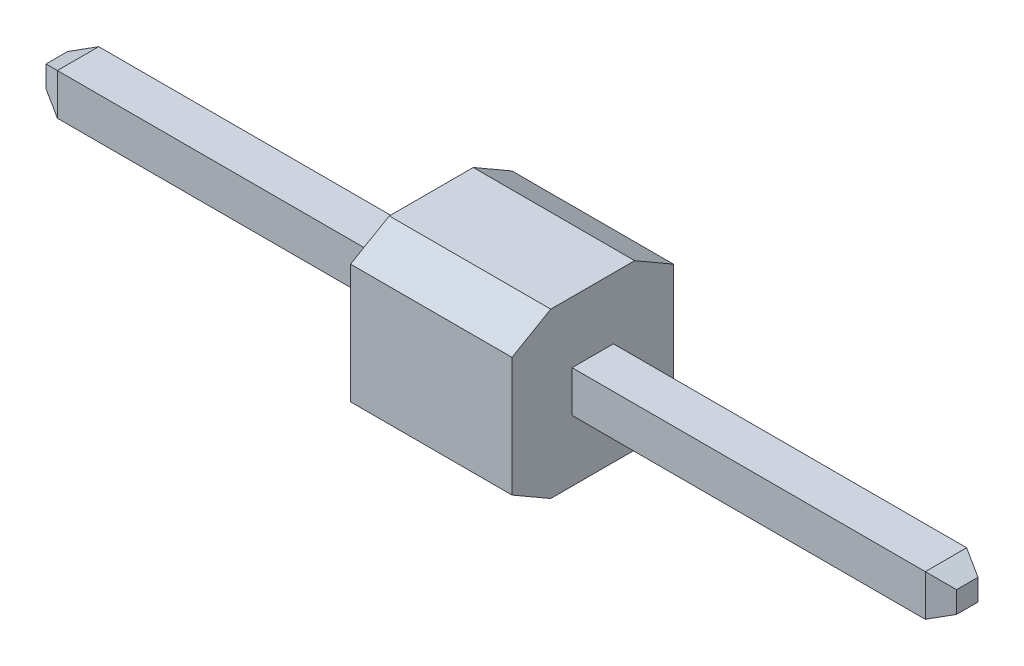
ISO-10303-21;
HEADER;
FILE_DESCRIPTION(('STEP AP214'),'2;1');
FILE_NAME('part.step','',(''),(''),'','','');
FILE_SCHEMA(('AUTOMOTIVE_DESIGN { 1 0 10303 214 1 1 1 1 }'));
ENDSEC;
DATA;
#1=APPLICATION_CONTEXT('core data for automotive mechanical design processes');
#2=APPLICATION_PROTOCOL_DEFINITION('international standard','automotive_design',2000,#1);
#3=PRODUCT_CONTEXT('',#1,'mechanical');
#4=PRODUCT('Part','Part','',(#3));
#5=PRODUCT_RELATED_PRODUCT_CATEGORY('part','',(#4));
#6=PRODUCT_DEFINITION_FORMATION('','',#4);
#7=PRODUCT_DEFINITION_CONTEXT('part definition',#1,'design');
#8=PRODUCT_DEFINITION('design','',#6,#7);
#9=PRODUCT_DEFINITION_SHAPE('','',#8);
#10=(LENGTH_UNIT() NAMED_UNIT(*) SI_UNIT(.MILLI.,.METRE.));
#11=(NAMED_UNIT(*) PLANE_ANGLE_UNIT() SI_UNIT($,.RADIAN.));
#12=(NAMED_UNIT(*) SI_UNIT($,.STERADIAN.) SOLID_ANGLE_UNIT());
#13=UNCERTAINTY_MEASURE_WITH_UNIT(LENGTH_MEASURE(1.E-05),#10,'distance_accuracy_value','');
#14=(GEOMETRIC_REPRESENTATION_CONTEXT(3) GLOBAL_UNCERTAINTY_ASSIGNED_CONTEXT((#13)) GLOBAL_UNIT_ASSIGNED_CONTEXT((#10,
#11,#12)) REPRESENTATION_CONTEXT('',''));
#15=CARTESIAN_POINT('',(0.,0.,0.));
#16=DIRECTION('',(0.,0.,1.));
#17=DIRECTION('',(1.,0.,0.));
#18=AXIS2_PLACEMENT_3D('',#15,#16,#17);
#19=CARTESIAN_POINT('',(5.42109943828666,-9.84288427394286,-2.77111970734936));
#20=DIRECTION('',(1.,-9.93476518829084E-08,4.37113882867379E-08));
#21=DIRECTION('',(-9.93476589883358E-08,-1.,8.74227765734759E-08));
#22=AXIS2_PLACEMENT_3D('',#19,#20,#21);
#23=PLANE('',#22);
#24=DIRECTION('',(-1.18186632778994E-08,-0.500000075710538,-0.866025360072935));
#25=VECTOR('',#24,1.);
#26=CARTESIAN_POINT('',(5.42109924611205,-11.0864739751751,-1.20111959863128));
#27=LINE('',#26,#25);
#28=CARTESIAN_POINT('',(5.42109924611205,-11.0864739751751,-1.20111959863128));
#29=VERTEX_POINT('',#28);
#30=CARTESIAN_POINT('',(5.42109923792384,-11.4328841891428,-1.80111956834714));
#31=VERTEX_POINT('',#30);
#32=EDGE_CURVE('E11',#29,#31,#27,.T.);
#33=ORIENTED_EDGE('',*,*,#32,.T.);
#34=DIRECTION('',(4.37113811813104E-08,-8.74227842254741E-08,-0.999999999999995));
#35=VECTOR('',#34,1.);
#36=CARTESIAN_POINT('',(5.42109923792384,-11.4328841891428,-1.80111956834714));
#37=LINE('',#36,#35);
#38=CARTESIAN_POINT('',(5.42109929474864,-11.4328843027924,-3.10111956834714));
#39=VERTEX_POINT('',#38);
#40=EDGE_CURVE('E304',#31,#39,#37,.T.);
#41=ORIENTED_EDGE('',*,*,#40,.T.);
#42=DIRECTION('',(8.75289963529268E-08,0.499999924289837,-0.866025447495713));
#43=VECTOR('',#42,1.);
#44=CARTESIAN_POINT('',(5.42109929474864,-11.4328843027924,-3.10111956834714));
#45=LINE('',#44,#43);
#46=CARTESIAN_POINT('',(5.4210993553905,-11.086474193732,-3.70111959863128));
#47=VERTEX_POINT('',#46);
#48=EDGE_CURVE('E296',#39,#47,#45,.T.);
#49=ORIENTED_EDGE('',*,*,#48,.T.);
#50=DIRECTION('',(9.93476593243698E-08,0.999999999999991,-8.74227764821842E-08));
#51=VECTOR('',#50,1.);
#52=CARTESIAN_POINT('',(5.4210993553905,-11.086474193732,-3.70111959863128));
#53=LINE('',#52,#51);
#54=CARTESIAN_POINT('',(5.42109953890348,-9.23929451676005,-3.70111976011686));
#55=VERTEX_POINT('',#54);
#56=EDGE_CURVE('E281',#47,#55,#53,.T.);
#57=ORIENTED_EDGE('',*,*,#56,.T.);
#58=DIRECTION('',(-1.18186619959243E-08,-0.500000075710538,-0.866025360072935));
#59=VECTOR('',#58,1.);
#60=CARTESIAN_POINT('',(5.42109954709169,-8.89288430279238,-3.10111979040099));
#61=LINE('',#60,#59);
#62=CARTESIAN_POINT('',(5.42109954709169,-8.89288430279238,-3.10111979040099));
#63=VERTEX_POINT('',#62);
#64=EDGE_CURVE('E265',#63,#55,#61,.T.);
#65=ORIENTED_EDGE('',*,*,#64,.F.);
#66=DIRECTION('',(4.37113811813104E-08,-8.74227842254741E-08,-0.999999999999995));
#67=VECTOR('',#66,1.);
#68=CARTESIAN_POINT('',(5.42109949026689,-8.89288418914276,-1.80111979040099));
#69=LINE('',#68,#67);
#70=CARTESIAN_POINT('',(5.42109949026689,-8.89288418914276,-1.80111979040099));
#71=VERTEX_POINT('',#70);
#72=EDGE_CURVE('E248',#71,#63,#69,.T.);
#73=ORIENTED_EDGE('',*,*,#72,.F.);
#74=DIRECTION('',(8.75289950709517E-08,0.499999924289837,-0.866025447495713));
#75=VECTOR('',#74,1.);
#76=CARTESIAN_POINT('',(5.42109942962503,-9.23929429820309,-1.20111976011686));
#77=LINE('',#76,#75);
#78=CARTESIAN_POINT('',(5.42109942962503,-9.23929429820309,-1.20111976011686));
#79=VERTEX_POINT('',#78);
#80=EDGE_CURVE('E242',#79,#71,#77,.T.);
#81=ORIENTED_EDGE('',*,*,#80,.F.);
#82=DIRECTION('',(9.93476593243698E-08,0.999999999999991,-8.74227764821842E-08));
#83=VECTOR('',#82,1.);
#84=CARTESIAN_POINT('',(5.42109924611205,-11.0864739751751,-1.20111959863128));
#85=LINE('',#84,#83);
#86=EDGE_CURVE('E236',#29,#79,#85,.T.);
#87=ORIENTED_EDGE('',*,*,#86,.F.);
#88=EDGE_LOOP('',(#33,#41,#49,#57,#65,#73,#81,#87));
#89=FACE_BOUND('',#88,.T.);
#90=DIRECTION('',(-4.37113817364219E-08,8.74227829017466E-08,0.999999999999995));
#91=VECTOR('',#90,1.);
#92=CARTESIAN_POINT('',(5.42109937470416,-10.4828842739429,-2.77111965139878));
#93=LINE('',#92,#91);
#94=CARTESIAN_POINT('',(5.42109937470416,-10.4828842739429,-2.77111965139878));
#95=VERTEX_POINT('',#94);
#96=CARTESIAN_POINT('',(5.42109934672887,-10.4828842179923,-2.13111965139878));
#97=VERTEX_POINT('',#96);
#98=EDGE_CURVE('E302',#95,#97,#93,.T.);
#99=ORIENTED_EDGE('',*,*,#98,.T.);
#100=DIRECTION('',(-9.93476592658906E-08,-0.999999999999991,8.74227766567418E-08));
#101=VECTOR('',#100,1.);
#102=CARTESIAN_POINT('',(5.42109941031137,-9.84288421799228,-2.13111970734936));
#103=LINE('',#102,#101);
#104=CARTESIAN_POINT('',(5.42109941031137,-9.84288421799228,-2.13111970734936));
#105=VERTEX_POINT('',#104);
#106=EDGE_CURVE('E293',#105,#97,#103,.T.);
#107=ORIENTED_EDGE('',*,*,#106,.F.);
#108=DIRECTION('',(-4.37113817364219E-08,8.74227856773042E-08,0.999999999999995));
#109=VECTOR('',#108,1.);
#110=CARTESIAN_POINT('',(5.42109943828666,-9.84288427394286,-2.77111970734936));
#111=LINE('',#110,#109);
#112=CARTESIAN_POINT('',(5.42109943828666,-9.84288427394286,-2.77111970734936));
#113=VERTEX_POINT('',#112);
#114=EDGE_CURVE('E278',#113,#105,#111,.T.);
#115=ORIENTED_EDGE('',*,*,#114,.F.);
#116=DIRECTION('',(-9.93476592658908E-08,-0.999999999999991,8.7422776656742E-08));
#117=VECTOR('',#116,1.);
#118=CARTESIAN_POINT('',(5.42109943828666,-9.84288427394286,-2.77111970734936));
#119=LINE('',#118,#117);
#120=EDGE_CURVE('E263',#113,#95,#119,.T.);
#121=ORIENTED_EDGE('',*,*,#120,.T.);
#122=EDGE_LOOP('',(#99,#107,#115,#121));
#123=FACE_BOUND('',#122,.T.);
#124=ADVANCED_FACE('F17',(#89,#123),#23,.T.);
#125=CARTESIAN_POINT('',(2.92109943828666,-9.84288402557373,-2.77111981662783));
#126=DIRECTION('',(1.,-9.93476518829084E-08,4.37113882867379E-08));
#127=DIRECTION('',(-9.93476589883358E-08,-1.,8.74227765734759E-08));
#128=AXIS2_PLACEMENT_3D('',#125,#126,#127);
#129=PLANE('',#128);
#130=DIRECTION('',(-1.18186632778994E-08,-0.500000075710538,-0.866025360072935));
#131=VECTOR('',#130,1.);
#132=CARTESIAN_POINT('',(2.92109924611205,-11.086473726806,-1.20111970790975));
#133=LINE('',#132,#131);
#134=CARTESIAN_POINT('',(2.92109924611205,-11.086473726806,-1.20111970790975));
#135=VERTEX_POINT('',#134);
#136=CARTESIAN_POINT('',(2.92109923792384,-11.4328839407736,-1.80111967762561));
#137=VERTEX_POINT('',#136);
#138=EDGE_CURVE('E24',#135,#137,#133,.T.);
#139=ORIENTED_EDGE('',*,*,#138,.F.);
#140=DIRECTION('',(9.9347659083955E-08,0.999999999999991,-8.74227764821842E-08));
#141=VECTOR('',#140,1.);
#142=CARTESIAN_POINT('',(2.92109924611205,-11.086473726806,-1.20111970790975));
#143=LINE('',#142,#141);
#144=CARTESIAN_POINT('',(2.92109942962503,-9.23929404983396,-1.20111986939533));
#145=VERTEX_POINT('',#144);
#146=EDGE_CURVE('E300',#135,#145,#143,.T.);
#147=ORIENTED_EDGE('',*,*,#146,.T.);
#148=DIRECTION('',(8.75289957119392E-08,0.499999924289837,-0.866025447495713));
#149=VECTOR('',#148,1.);
#150=CARTESIAN_POINT('',(2.92109942962503,-9.23929404983396,-1.20111986939533));
#151=LINE('',#150,#149);
#152=CARTESIAN_POINT('',(2.92109949026689,-8.89288394077363,-1.80111989967946));
#153=VERTEX_POINT('',#152);
#154=EDGE_CURVE('E286',#145,#153,#151,.T.);
#155=ORIENTED_EDGE('',*,*,#154,.T.);
#156=DIRECTION('',(4.37113811813104E-08,-8.74227842254741E-08,-0.999999999999995));
#157=VECTOR('',#156,1.);
#158=CARTESIAN_POINT('',(2.92109949026689,-8.89288394077363,-1.80111989967946));
#159=LINE('',#158,#157);
#160=CARTESIAN_POINT('',(2.92109954709169,-8.89288405442325,-3.10111989967946));
#161=VERTEX_POINT('',#160);
#162=EDGE_CURVE('E271',#153,#161,#159,.T.);
#163=ORIENTED_EDGE('',*,*,#162,.T.);
#164=DIRECTION('',(-1.18186626369119E-08,-0.500000075710538,-0.866025360072935));
#165=VECTOR('',#164,1.);
#166=CARTESIAN_POINT('',(2.92109954709169,-8.89288405442325,-3.10111989967946));
#167=LINE('',#166,#165);
#168=CARTESIAN_POINT('',(2.92109953890348,-9.23929426839092,-3.70111986939533));
#169=VERTEX_POINT('',#168);
#170=EDGE_CURVE('E253',#161,#169,#167,.T.);
#171=ORIENTED_EDGE('',*,*,#170,.T.);
#172=DIRECTION('',(9.9347659083955E-08,0.999999999999991,-8.74227764821842E-08));
#173=VECTOR('',#172,1.);
#174=CARTESIAN_POINT('',(2.9210993553905,-11.0864739453629,-3.70111970790975));
#175=LINE('',#174,#173);
#176=CARTESIAN_POINT('',(2.9210993553905,-11.0864739453629,-3.70111970790975));
#177=VERTEX_POINT('',#176);
#178=EDGE_CURVE('E261',#177,#169,#175,.T.);
#179=ORIENTED_EDGE('',*,*,#178,.F.);
#180=DIRECTION('',(8.75289963529268E-08,0.499999924289837,-0.866025447495713));
#181=VECTOR('',#180,1.);
#182=CARTESIAN_POINT('',(2.92109929474864,-11.4328840544232,-3.10111967762561));
#183=LINE('',#182,#181);
#184=CARTESIAN_POINT('',(2.92109929474864,-11.4328840544232,-3.10111967762561));
#185=VERTEX_POINT('',#184);
#186=EDGE_CURVE('E276',#185,#177,#183,.T.);
#187=ORIENTED_EDGE('',*,*,#186,.F.);
#188=DIRECTION('',(4.37113811813104E-08,-8.74227842254741E-08,-0.999999999999995));
#189=VECTOR('',#188,1.);
#190=CARTESIAN_POINT('',(2.92109923792384,-11.4328839407736,-1.80111967762561));
#191=LINE('',#190,#189);
#192=EDGE_CURVE('E291',#137,#185,#191,.T.);
#193=ORIENTED_EDGE('',*,*,#192,.F.);
#194=EDGE_LOOP('',(#139,#147,#155,#163,#171,#179,#187,#193));
#195=FACE_BOUND('',#194,.T.);
#196=DIRECTION('',(-9.93476585720012E-08,-0.999999999999991,8.74227766567418E-08));
#197=VECTOR('',#196,1.);
#198=CARTESIAN_POINT('',(2.92109941031137,-9.84288396962315,-2.13111981662783));
#199=LINE('',#198,#197);
#200=CARTESIAN_POINT('',(2.92109941031137,-9.84288396962315,-2.13111981662783));
#201=VERTEX_POINT('',#200);
#202=CARTESIAN_POINT('',(2.92109934672887,-10.4828839696231,-2.13111976067725));
#203=VERTEX_POINT('',#202);
#204=EDGE_CURVE('E298',#201,#203,#199,.T.);
#205=ORIENTED_EDGE('',*,*,#204,.T.);
#206=DIRECTION('',(-4.37113810425325E-08,8.74227829017466E-08,0.999999999999995));
#207=VECTOR('',#206,1.);
#208=CARTESIAN_POINT('',(2.92109937470416,-10.4828840255737,-2.77111976067725));
#209=LINE('',#208,#207);
#210=CARTESIAN_POINT('',(2.92109937470416,-10.4828840255737,-2.77111976067725));
#211=VERTEX_POINT('',#210);
#212=EDGE_CURVE('E283',#211,#203,#209,.T.);
#213=ORIENTED_EDGE('',*,*,#212,.F.);
#214=DIRECTION('',(-9.93476592658908E-08,-0.999999999999991,8.7422776656742E-08));
#215=VECTOR('',#214,1.);
#216=CARTESIAN_POINT('',(2.92109943828666,-9.84288402557373,-2.77111981662783));
#217=LINE('',#216,#215);
#218=CARTESIAN_POINT('',(2.92109943828666,-9.84288402557373,-2.77111981662783));
#219=VERTEX_POINT('',#218);
#220=EDGE_CURVE('E268',#219,#211,#217,.T.);
#221=ORIENTED_EDGE('',*,*,#220,.F.);
#222=DIRECTION('',(-4.37113817364219E-08,8.74227856773042E-08,0.999999999999995));
#223=VECTOR('',#222,1.);
#224=CARTESIAN_POINT('',(2.92109943828666,-9.84288402557373,-2.77111981662783));
#225=LINE('',#224,#223);
#226=EDGE_CURVE('E251',#219,#201,#225,.T.);
#227=ORIENTED_EDGE('',*,*,#226,.T.);
#228=EDGE_LOOP('',(#205,#213,#221,#227));
#229=FACE_BOUND('',#228,.T.);
#230=ADVANCED_FACE('F314',(#195,#229),#129,.F.);
#231=CARTESIAN_POINT('',(5.42109924611205,-11.0864739751751,-1.20111959863128));
#232=DIRECTION('',(1.07893287081065E-07,0.866025360072937,-0.500000075710535));
#233=DIRECTION('',(1.18186629566715E-08,0.500000075710542,0.866025360072941));
#234=AXIS2_PLACEMENT_3D('',#231,#232,#233);
#235=PLANE('',#234);
#236=ORIENTED_EDGE('',*,*,#138,.T.);
#237=DIRECTION('',(-0.999999999999994,9.93476518829078E-08,-4.37113883755555E-08));
#238=VECTOR('',#237,1.);
#239=CARTESIAN_POINT('',(5.42109923792384,-11.4328841891428,-1.80111956834714));
#240=LINE('',#239,#238);
#241=EDGE_CURVE('E288',#31,#137,#240,.T.);
#242=ORIENTED_EDGE('',*,*,#241,.F.);
#243=ORIENTED_EDGE('',*,*,#32,.F.);
#244=DIRECTION('',(-0.999999999999994,9.93476518829078E-08,-4.3711388109102E-08));
#245=VECTOR('',#244,1.);
#246=CARTESIAN_POINT('',(5.42109924611205,-11.0864739751751,-1.20111959863128));
#247=LINE('',#246,#245);
#248=EDGE_CURVE('E256',#29,#135,#247,.T.);
#249=ORIENTED_EDGE('',*,*,#248,.T.);
#250=EDGE_LOOP('',(#236,#242,#243,#249));
#251=FACE_BOUND('',#250,.T.);
#252=ADVANCED_FACE('F306',(#251),#235,.F.);
#253=CARTESIAN_POINT('',(5.42109923792384,-11.4328841891428,-1.80111956834714));
#254=DIRECTION('',(9.93476589883358E-08,1.,-8.74227765734759E-08));
#255=DIRECTION('',(1.,-9.93476518829084E-08,4.37113882867379E-08));
#256=AXIS2_PLACEMENT_3D('',#253,#254,#255);
#257=PLANE('',#256);
#258=ORIENTED_EDGE('',*,*,#192,.T.);
#259=DIRECTION('',(-0.999999999999994,9.93476518829078E-08,-4.37113882867377E-08));
#260=VECTOR('',#259,1.);
#261=CARTESIAN_POINT('',(5.42109929474864,-11.4328843027924,-3.10111956834714));
#262=LINE('',#261,#260);
#263=EDGE_CURVE('E273',#39,#185,#262,.T.);
#264=ORIENTED_EDGE('',*,*,#263,.F.);
#265=ORIENTED_EDGE('',*,*,#40,.F.);
#266=ORIENTED_EDGE('',*,*,#241,.T.);
#267=EDGE_LOOP('',(#258,#264,#265,#266));
#268=FACE_BOUND('',#267,.T.);
#269=ADVANCED_FACE('F311',(#268),#257,.F.);
#270=CARTESIAN_POINT('',(5.42109929474864,-11.4328843027924,-3.10111956834714));
#271=DIRECTION('',(6.41819058997377E-08,0.866025447495721,0.499999924289845));
#272=DIRECTION('',(-8.7528996031702E-08,-0.499999924289838,0.866025447495717));
#273=AXIS2_PLACEMENT_3D('',#270,#271,#272);
#274=PLANE('',#273);
#275=ORIENTED_EDGE('',*,*,#186,.T.);
#276=DIRECTION('',(-0.999999999999994,9.93476518829078E-08,-4.37113882867377E-08));
#277=VECTOR('',#276,1.);
#278=CARTESIAN_POINT('',(5.4210993553905,-11.086474193732,-3.70111959863128));
#279=LINE('',#278,#277);
#280=EDGE_CURVE('E258',#47,#177,#279,.T.);
#281=ORIENTED_EDGE('',*,*,#280,.F.);
#282=ORIENTED_EDGE('',*,*,#48,.F.);
#283=ORIENTED_EDGE('',*,*,#263,.T.);
#284=EDGE_LOOP('',(#275,#281,#282,#283));
#285=FACE_BOUND('',#284,.T.);
#286=ADVANCED_FACE('F319',(#285),#274,.F.);
#287=CARTESIAN_POINT('',(5.4210993553905,-11.086474193732,-3.70111959863128));
#288=DIRECTION('',(-4.37113811813106E-08,8.74227836789032E-08,1.));
#289=DIRECTION('',(-1.,9.93476518829084E-08,-4.37113882867379E-08));
#290=AXIS2_PLACEMENT_3D('',#287,#288,#289);
#291=PLANE('',#290);
#292=ORIENTED_EDGE('',*,*,#178,.T.);
#293=DIRECTION('',(-0.999999999999994,9.93476525934505E-08,-4.37113882867377E-08));
#294=VECTOR('',#293,1.);
#295=CARTESIAN_POINT('',(5.42109953890348,-9.23929451676005,-3.70111976011686));
#296=LINE('',#295,#294);
#297=EDGE_CURVE('E245',#55,#169,#296,.T.);
#298=ORIENTED_EDGE('',*,*,#297,.F.);
#299=ORIENTED_EDGE('',*,*,#56,.F.);
#300=ORIENTED_EDGE('',*,*,#280,.T.);
#301=EDGE_LOOP('',(#292,#298,#299,#300));
#302=FACE_BOUND('',#301,.T.);
#303=ADVANCED_FACE('F326',(#302),#291,.F.);
#304=CARTESIAN_POINT('',(5.42109954709169,-8.89288430279238,-3.10111979040099));
#305=DIRECTION('',(1.07893287081065E-07,0.866025360072937,-0.500000075710535));
#306=DIRECTION('',(1.18186629566715E-08,0.500000075710542,0.866025360072941));
#307=AXIS2_PLACEMENT_3D('',#304,#305,#306);
#308=PLANE('',#307);
#309=ORIENTED_EDGE('',*,*,#170,.F.);
#310=DIRECTION('',(-0.999999999999994,9.93476518829078E-08,-4.37113882867377E-08));
#311=VECTOR('',#310,1.);
#312=CARTESIAN_POINT('',(5.42109954709169,-8.89288430279238,-3.10111979040099));
#313=LINE('',#312,#311);
#314=EDGE_CURVE('E239',#63,#161,#313,.T.);
#315=ORIENTED_EDGE('',*,*,#314,.F.);
#316=ORIENTED_EDGE('',*,*,#64,.T.);
#317=ORIENTED_EDGE('',*,*,#297,.T.);
#318=EDGE_LOOP('',(#309,#315,#316,#317));
#319=FACE_BOUND('',#318,.T.);
#320=ADVANCED_FACE('F329',(#319),#308,.T.);
#321=CARTESIAN_POINT('',(5.42109949026689,-8.89288418914276,-1.80111979040099));
#322=DIRECTION('',(9.93476589883358E-08,1.,-8.74227765734759E-08));
#323=DIRECTION('',(1.,-9.93476518829084E-08,4.37113882867379E-08));
#324=AXIS2_PLACEMENT_3D('',#321,#322,#323);
#325=PLANE('',#324);
#326=ORIENTED_EDGE('',*,*,#162,.F.);
#327=DIRECTION('',(-0.999999999999994,9.93476518829078E-08,-4.37113883755555E-08));
#328=VECTOR('',#327,1.);
#329=CARTESIAN_POINT('',(5.42109949026689,-8.89288418914276,-1.80111979040099));
#330=LINE('',#329,#328);
#331=EDGE_CURVE('E233',#71,#153,#330,.T.);
#332=ORIENTED_EDGE('',*,*,#331,.F.);
#333=ORIENTED_EDGE('',*,*,#72,.T.);
#334=ORIENTED_EDGE('',*,*,#314,.T.);
#335=EDGE_LOOP('',(#326,#332,#333,#334));
#336=FACE_BOUND('',#335,.T.);
#337=ADVANCED_FACE('F333',(#336),#325,.T.);
#338=CARTESIAN_POINT('',(5.42109942962503,-9.23929429820309,-1.20111976011686));
#339=DIRECTION('',(6.41819058997377E-08,0.866025447495721,0.499999924289845));
#340=DIRECTION('',(-8.7528996031702E-08,-0.499999924289838,0.866025447495717));
#341=AXIS2_PLACEMENT_3D('',#338,#339,#340);
#342=PLANE('',#341);
#343=ORIENTED_EDGE('',*,*,#154,.F.);
#344=DIRECTION('',(-0.999999999999994,9.93476525934505E-08,-4.3711388109102E-08));
#345=VECTOR('',#344,1.);
#346=CARTESIAN_POINT('',(5.42109942962503,-9.23929429820309,-1.20111976011686));
#347=LINE('',#346,#345);
#348=EDGE_CURVE('E230',#79,#145,#347,.T.);
#349=ORIENTED_EDGE('',*,*,#348,.F.);
#350=ORIENTED_EDGE('',*,*,#80,.T.);
#351=ORIENTED_EDGE('',*,*,#331,.T.);
#352=EDGE_LOOP('',(#343,#349,#350,#351));
#353=FACE_BOUND('',#352,.T.);
#354=ADVANCED_FACE('F337',(#353),#342,.T.);
#355=CARTESIAN_POINT('',(5.42109924611205,-11.0864739751751,-1.20111959863128));
#356=DIRECTION('',(-4.37113811813106E-08,8.74227835615132E-08,1.));
#357=DIRECTION('',(-9.93476589883358E-08,-1.,8.74227764560859E-08));
#358=AXIS2_PLACEMENT_3D('',#355,#356,#357);
#359=PLANE('',#358);
#360=ORIENTED_EDGE('',*,*,#146,.F.);
#361=ORIENTED_EDGE('',*,*,#248,.F.);
#362=ORIENTED_EDGE('',*,*,#86,.T.);
#363=ORIENTED_EDGE('',*,*,#348,.T.);
#364=EDGE_LOOP('',(#360,#361,#362,#363));
#365=FACE_BOUND('',#364,.T.);
#366=ADVANCED_FACE('F339',(#365),#359,.T.);
#367=CARTESIAN_POINT('',(-2.87890056171334,-9.84288344935735,-2.77112007015388));
#368=DIRECTION('',(-1.,9.93476518829084E-08,-4.37113882867379E-08));
#369=DIRECTION('',(9.93476589883358E-08,1.,-8.74227765734759E-08));
#370=AXIS2_PLACEMENT_3D('',#367,#368,#369);
#371=PLANE('',#370);
#372=DIRECTION('',(9.93476581453995E-08,0.999999999999991,-8.74227761394067E-08));
#373=VECTOR('',#372,1.);
#374=CARTESIAN_POINT('',(-2.87890063125698,-10.3290018796685,-2.28500155484705));
#375=LINE('',#374,#373);
#376=CARTESIAN_POINT('',(-2.87890063125698,-10.3290018796685,-2.28500155484705));
#377=VERTEX_POINT('',#376);
#378=CARTESIAN_POINT('',(-2.87890059825002,-9.99676493405052,-2.28500158389213));
#379=VERTEX_POINT('',#378);
#380=EDGE_CURVE('E228',#377,#379,#375,.T.);
#381=ORIENTED_EDGE('',*,*,#380,.T.);
#382=DIRECTION('',(4.37113820547149E-08,-8.74227801493995E-08,-0.999999999999995));
#383=VECTOR('',#382,1.);
#384=CARTESIAN_POINT('',(-2.87890059825002,-9.99676493405052,-2.28500158389213));
#385=LINE('',#384,#383);
#386=CARTESIAN_POINT('',(-2.87890058372749,-9.9967649630956,-2.61723852951013));
#387=VERTEX_POINT('',#386);
#388=EDGE_CURVE('E223',#379,#387,#385,.T.);
#389=ORIENTED_EDGE('',*,*,#388,.T.);
#390=DIRECTION('',(-9.93476608187272E-08,-0.999999999999991,8.74227761394063E-08));
#391=VECTOR('',#390,1.);
#392=CARTESIAN_POINT('',(-2.87890058372748,-9.9967649630956,-2.61723852951013));
#393=LINE('',#392,#391);
#394=CARTESIAN_POINT('',(-2.87890061673445,-10.3290019087136,-2.61723850046505));
#395=VERTEX_POINT('',#394);
#396=EDGE_CURVE('E215',#387,#395,#393,.T.);
#397=ORIENTED_EDGE('',*,*,#396,.T.);
#398=DIRECTION('',(-4.37113740347301E-08,8.74227801493995E-08,0.999999999999995));
#399=VECTOR('',#398,1.);
#400=CARTESIAN_POINT('',(-2.87890061673445,-10.3290019087136,-2.61723850046505));
#401=LINE('',#400,#399);
#402=EDGE_CURVE('E207',#395,#377,#401,.T.);
#403=ORIENTED_EDGE('',*,*,#402,.T.);
#404=EDGE_LOOP('',(#381,#389,#397,#403));
#405=FACE_BOUND('',#404,.T.);
#406=ADVANCED_FACE('F341',(#405),#371,.T.);
#407=CARTESIAN_POINT('',(-2.87890056171334,-9.84288344935735,-2.77112007015388));
#408=DIRECTION('',(9.93476589883358E-08,1.,-8.74227764510112E-08));
#409=DIRECTION('',(-4.37113811813106E-08,8.74227835564385E-08,1.));
#410=AXIS2_PLACEMENT_3D('',#407,#408,#409);
#411=PLANE('',#410);
#412=DIRECTION('',(0.999999999999994,-9.93476521037346E-08,4.37113882769953E-08));
#413=VECTOR('',#412,1.);
#414=CARTESIAN_POINT('',(-2.54890056171334,-9.84288348214207,-2.77112005572912));
#415=LINE('',#414,#413);
#416=CARTESIAN_POINT('',(-2.54890056171334,-9.84288348214207,-2.77112005572912));
#417=VERTEX_POINT('',#416);
#418=EDGE_CURVE('E225',#417,#219,#415,.T.);
#419=ORIENTED_EDGE('',*,*,#418,.F.);
#420=DIRECTION('',(-4.37113817364219E-08,8.74227829017466E-08,0.999999999999995));
#421=VECTOR('',#420,1.);
#422=CARTESIAN_POINT('',(-2.54890056171334,-9.84288348214207,-2.77112005572912));
#423=LINE('',#422,#421);
#424=CARTESIAN_POINT('',(-2.54890058968863,-9.84288342619149,-2.13112005572912));
#425=VERTEX_POINT('',#424);
#426=EDGE_CURVE('E217',#417,#425,#423,.T.);
#427=ORIENTED_EDGE('',*,*,#426,.T.);
#428=DIRECTION('',(0.999999999999994,-9.93476521037346E-08,4.3711388195809E-08));
#429=VECTOR('',#428,1.);
#430=CARTESIAN_POINT('',(-2.54890058968863,-9.84288342619149,-2.13112005572912));
#431=LINE('',#430,#429);
#432=EDGE_CURVE('E220',#425,#201,#431,.T.);
#433=ORIENTED_EDGE('',*,*,#432,.T.);
#434=ORIENTED_EDGE('',*,*,#226,.F.);
#435=EDGE_LOOP('',(#419,#427,#433,#434));
#436=FACE_BOUND('',#435,.T.);
#437=ADVANCED_FACE('F348',(#436),#411,.T.);
#438=CARTESIAN_POINT('',(-2.87890058968863,-9.84288339340677,-2.13112007015388));
#439=DIRECTION('',(-4.37113811813106E-08,8.74227836789032E-08,1.));
#440=DIRECTION('',(-1.,9.93476518829084E-08,-4.37113882867379E-08));
#441=AXIS2_PLACEMENT_3D('',#438,#439,#440);
#442=PLANE('',#441);
#443=ORIENTED_EDGE('',*,*,#432,.F.);
#444=DIRECTION('',(-9.93476592658906E-08,-0.999999999999991,8.74227766567418E-08));
#445=VECTOR('',#444,1.);
#446=CARTESIAN_POINT('',(-2.54890058968863,-9.84288342619149,-2.13112005572912));
#447=LINE('',#446,#445);
#448=CARTESIAN_POINT('',(-2.54890065327113,-10.4828834261915,-2.13111999977854));
#449=VERTEX_POINT('',#448);
#450=EDGE_CURVE('E209',#425,#449,#447,.T.);
#451=ORIENTED_EDGE('',*,*,#450,.T.);
#452=DIRECTION('',(0.999999999999994,-9.93476517789893E-08,4.3711388195809E-08));
#453=VECTOR('',#452,1.);
#454=CARTESIAN_POINT('',(-2.54890065327113,-10.4828834261915,-2.13111999977854));
#455=LINE('',#454,#453);
#456=EDGE_CURVE('E212',#449,#203,#455,.T.);
#457=ORIENTED_EDGE('',*,*,#456,.T.);
#458=ORIENTED_EDGE('',*,*,#204,.F.);
#459=EDGE_LOOP('',(#443,#451,#457,#458));
#460=FACE_BOUND('',#459,.T.);
#461=ADVANCED_FACE('F424',(#460),#442,.T.);
#462=CARTESIAN_POINT('',(-2.87890062529584,-10.4828834493573,-2.7711200142033));
#463=DIRECTION('',(9.93476589883357E-08,1.,-8.74227764040693E-08));
#464=DIRECTION('',(-4.37113811813106E-08,8.74227835094966E-08,1.));
#465=AXIS2_PLACEMENT_3D('',#462,#463,#464);
#466=PLANE('',#465);
#467=ORIENTED_EDGE('',*,*,#456,.F.);
#468=DIRECTION('',(4.37113831242006E-08,-8.74227829017466E-08,-0.999999999999995));
#469=VECTOR('',#468,1.);
#470=CARTESIAN_POINT('',(-2.54890065327113,-10.4828834261915,-2.13111999977854));
#471=LINE('',#470,#469);
#472=CARTESIAN_POINT('',(-2.54890062529584,-10.4828834821421,-2.77111999977854));
#473=VERTEX_POINT('',#472);
#474=EDGE_CURVE('E201',#449,#473,#471,.T.);
#475=ORIENTED_EDGE('',*,*,#474,.T.);
#476=DIRECTION('',(0.999999999999994,-9.93476517789893E-08,4.37113882769953E-08));
#477=VECTOR('',#476,1.);
#478=CARTESIAN_POINT('',(-2.54890062529584,-10.4828834821421,-2.77111999977854));
#479=LINE('',#478,#477);
#480=EDGE_CURVE('E204',#473,#211,#479,.T.);
#481=ORIENTED_EDGE('',*,*,#480,.T.);
#482=ORIENTED_EDGE('',*,*,#212,.T.);
#483=EDGE_LOOP('',(#467,#475,#481,#482));
#484=FACE_BOUND('',#483,.T.);
#485=ADVANCED_FACE('F421',(#484),#466,.F.);
#486=CARTESIAN_POINT('',(-2.87890056171334,-9.84288344935735,-2.77112007015388));
#487=DIRECTION('',(-4.37113811813106E-08,8.74227836789032E-08,1.));
#488=DIRECTION('',(-1.,9.93476518829084E-08,-4.37113882867379E-08));
#489=AXIS2_PLACEMENT_3D('',#486,#487,#488);
#490=PLANE('',#489);
#491=ORIENTED_EDGE('',*,*,#480,.F.);
#492=DIRECTION('',(9.93476606536693E-08,0.999999999999991,-8.74227766567418E-08));
#493=VECTOR('',#492,1.);
#494=CARTESIAN_POINT('',(-2.54890062529585,-10.4828834821421,-2.77111999977854));
#495=LINE('',#494,#493);
#496=EDGE_CURVE('E196',#473,#417,#495,.T.);
#497=ORIENTED_EDGE('',*,*,#496,.T.);
#498=ORIENTED_EDGE('',*,*,#418,.T.);
#499=ORIENTED_EDGE('',*,*,#220,.T.);
#500=EDGE_LOOP('',(#491,#497,#498,#499));
#501=FACE_BOUND('',#500,.T.);
#502=ADVANCED_FACE('F376',(#501),#490,.F.);
#503=CARTESIAN_POINT('',(-2.87890056171334,-9.84288344935735,-2.77112007015388));
#504=DIRECTION('',(-4.37113811813106E-08,8.74227836789032E-08,1.));
#505=DIRECTION('',(-1.,9.93476518829084E-08,-4.37113882867379E-08));
#506=AXIS2_PLACEMENT_3D('',#503,#504,#505);
#507=PLANE('',#506);
#508=DIRECTION('',(0.999999999999994,-9.93476517789893E-08,4.37113882769953E-08));
#509=VECTOR('',#508,1.);
#510=CARTESIAN_POINT('',(5.42109943828666,-9.84288427394286,-2.77111970734936));
#511=LINE('',#510,#509);
#512=CARTESIAN_POINT('',(10.8910994382867,-9.84288481737452,-2.77111946824806));
#513=VERTEX_POINT('',#512);
#514=EDGE_CURVE('E199',#113,#513,#511,.T.);
#515=ORIENTED_EDGE('',*,*,#514,.T.);
#516=DIRECTION('',(-9.93476606536693E-08,-0.999999999999991,8.74227766567418E-08));
#517=VECTOR('',#516,1.);
#518=CARTESIAN_POINT('',(10.8910994382867,-9.84288481737452,-2.77111946824806));
#519=LINE('',#518,#517);
#520=CARTESIAN_POINT('',(10.8910993747042,-10.4828848173745,-2.77111941229749));
#521=VERTEX_POINT('',#520);
#522=EDGE_CURVE('E191',#513,#521,#519,.T.);
#523=ORIENTED_EDGE('',*,*,#522,.T.);
#524=DIRECTION('',(0.999999999999994,-9.93476521037346E-08,4.37113882769953E-08));
#525=VECTOR('',#524,1.);
#526=CARTESIAN_POINT('',(5.42109937470416,-10.4828842739429,-2.77111965139878));
#527=LINE('',#526,#525);
#528=EDGE_CURVE('E194',#95,#521,#527,.T.);
#529=ORIENTED_EDGE('',*,*,#528,.F.);
#530=ORIENTED_EDGE('',*,*,#120,.F.);
#531=EDGE_LOOP('',(#515,#523,#529,#530));
#532=FACE_BOUND('',#531,.T.);
#533=ADVANCED_FACE('F367',(#532),#507,.F.);
#534=CARTESIAN_POINT('',(-2.87890062529584,-10.4828834493573,-2.7711200142033));
#535=DIRECTION('',(9.93476589883357E-08,1.,-8.74227764040693E-08));
#536=DIRECTION('',(-4.37113811813106E-08,8.74227835094966E-08,1.));
#537=AXIS2_PLACEMENT_3D('',#534,#535,#536);
#538=PLANE('',#537);
#539=ORIENTED_EDGE('',*,*,#528,.T.);
#540=DIRECTION('',(-4.37113817364219E-08,8.74227829017466E-08,0.999999999999995));
#541=VECTOR('',#540,1.);
#542=CARTESIAN_POINT('',(10.8910993747042,-10.4828848173745,-2.77111941229749));
#543=LINE('',#542,#541);
#544=CARTESIAN_POINT('',(10.8910993467289,-10.4828847614239,-2.13111941229749));
#545=VERTEX_POINT('',#544);
#546=EDGE_CURVE('E186',#521,#545,#543,.T.);
#547=ORIENTED_EDGE('',*,*,#546,.T.);
#548=DIRECTION('',(0.999999999999994,-9.93476521037346E-08,4.37113881146227E-08));
#549=VECTOR('',#548,1.);
#550=CARTESIAN_POINT('',(5.42109934672887,-10.4828842179923,-2.13111965139878));
#551=LINE('',#550,#549);
#552=EDGE_CURVE('E189',#97,#545,#551,.T.);
#553=ORIENTED_EDGE('',*,*,#552,.F.);
#554=ORIENTED_EDGE('',*,*,#98,.F.);
#555=EDGE_LOOP('',(#539,#547,#553,#554));
#556=FACE_BOUND('',#555,.T.);
#557=ADVANCED_FACE('F364',(#556),#538,.F.);
#558=CARTESIAN_POINT('',(-2.87890058968863,-9.84288339340677,-2.13112007015388));
#559=DIRECTION('',(-4.37113811813106E-08,8.74227836789032E-08,1.));
#560=DIRECTION('',(-1.,9.93476518829084E-08,-4.37113882867379E-08));
#561=AXIS2_PLACEMENT_3D('',#558,#559,#560);
#562=PLANE('',#561);
#563=ORIENTED_EDGE('',*,*,#552,.T.);
#564=DIRECTION('',(9.93476578781121E-08,0.999999999999991,-8.7422776656742E-08));
#565=VECTOR('',#564,1.);
#566=CARTESIAN_POINT('',(10.8910993467289,-10.4828847614239,-2.13111941229749));
#567=LINE('',#566,#565);
#568=CARTESIAN_POINT('',(10.8910994103114,-9.84288476142394,-2.13111946824806));
#569=VERTEX_POINT('',#568);
#570=EDGE_CURVE('E176',#545,#569,#567,.T.);
#571=ORIENTED_EDGE('',*,*,#570,.T.);
#572=DIRECTION('',(0.999999999999994,-9.93476517789893E-08,4.37113881146227E-08));
#573=VECTOR('',#572,1.);
#574=CARTESIAN_POINT('',(5.42109941031137,-9.84288421799228,-2.13111970734936));
#575=LINE('',#574,#573);
#576=EDGE_CURVE('E179',#105,#569,#575,.T.);
#577=ORIENTED_EDGE('',*,*,#576,.F.);
#578=ORIENTED_EDGE('',*,*,#106,.T.);
#579=EDGE_LOOP('',(#563,#571,#577,#578));
#580=FACE_BOUND('',#579,.T.);
#581=ADVANCED_FACE('F366',(#580),#562,.T.);
#582=CARTESIAN_POINT('',(-2.87890056171334,-9.84288344935735,-2.77112007015388));
#583=DIRECTION('',(9.93476589883358E-08,1.,-8.74227764510112E-08));
#584=DIRECTION('',(-4.37113811813106E-08,8.74227835564385E-08,1.));
#585=AXIS2_PLACEMENT_3D('',#582,#583,#584);
#586=PLANE('',#585);
#587=ORIENTED_EDGE('',*,*,#576,.T.);
#588=DIRECTION('',(4.37113817364219E-08,-8.74227829017466E-08,-0.999999999999995));
#589=VECTOR('',#588,1.);
#590=CARTESIAN_POINT('',(10.8910994103114,-9.84288476142394,-2.13111946824806));
#591=LINE('',#590,#589);
#592=EDGE_CURVE('E167',#569,#513,#591,.T.);
#593=ORIENTED_EDGE('',*,*,#592,.T.);
#594=ORIENTED_EDGE('',*,*,#514,.F.);
#595=ORIENTED_EDGE('',*,*,#114,.T.);
#596=EDGE_LOOP('',(#587,#593,#594,#595));
#597=FACE_BOUND('',#596,.T.);
#598=ADVANCED_FACE('F373',(#597),#586,.T.);
#599=CARTESIAN_POINT('',(11.2210994382867,-9.84288485015924,-2.7711194538233));
#600=DIRECTION('',(-1.,9.93476518829084E-08,-4.37113882867379E-08));
#601=DIRECTION('',(9.93476589883358E-08,1.,-8.74227765734759E-08));
#602=AXIS2_PLACEMENT_3D('',#599,#600,#601);
#603=PLANE('',#602);
#604=DIRECTION('',(-9.93476581453989E-08,-0.999999999999991,8.74227761394063E-08));
#605=VECTOR('',#604,1.);
#606=CARTESIAN_POINT('',(11.22109940175,-9.99676633485241,-2.28500096756155));
#607=LINE('',#606,#605);
#608=CARTESIAN_POINT('',(11.22109940175,-9.99676633485241,-2.28500096756155));
#609=VERTEX_POINT('',#608);
#610=CARTESIAN_POINT('',(11.221099368743,-10.3290032804704,-2.28500093851648));
#611=VERTEX_POINT('',#610);
#612=EDGE_CURVE('E153',#609,#611,#607,.T.);
#613=ORIENTED_EDGE('',*,*,#612,.T.);
#614=DIRECTION('',(4.37113820547149E-08,-8.74227801493994E-08,-0.999999999999995));
#615=VECTOR('',#614,1.);
#616=CARTESIAN_POINT('',(11.221099368743,-10.3290032804704,-2.28500093851648));
#617=LINE('',#616,#615);
#618=CARTESIAN_POINT('',(11.2210993832656,-10.3290033095155,-2.61723788413448));
#619=VERTEX_POINT('',#618);
#620=EDGE_CURVE('E395',#611,#619,#617,.T.);
#621=ORIENTED_EDGE('',*,*,#620,.T.);
#622=DIRECTION('',(9.93476581453995E-08,0.999999999999991,-8.74227761394067E-08));
#623=VECTOR('',#622,1.);
#624=CARTESIAN_POINT('',(11.2210993832656,-10.3290033095155,-2.61723788413448));
#625=LINE('',#624,#623);
#626=CARTESIAN_POINT('',(11.2210994162725,-9.99676636389749,-2.61723791317955));
#627=VERTEX_POINT('',#626);
#628=EDGE_CURVE('E156',#619,#627,#625,.T.);
#629=ORIENTED_EDGE('',*,*,#628,.T.);
#630=DIRECTION('',(-4.37113874013715E-08,8.74227801493995E-08,0.999999999999995));
#631=VECTOR('',#630,1.);
#632=CARTESIAN_POINT('',(11.2210994162725,-9.99676636389749,-2.61723791317955));
#633=LINE('',#632,#631);
#634=EDGE_CURVE('E149',#627,#609,#633,.T.);
#635=ORIENTED_EDGE('',*,*,#634,.T.);
#636=EDGE_LOOP('',(#613,#621,#629,#635));
#637=FACE_BOUND('',#636,.T.);
#638=ADVANCED_FACE('F151',(#637),#603,.F.);
#639=CARTESIAN_POINT('',(-2.87890061000808,-10.3290019221664,-2.77112002765605));
#640=DIRECTION('',(-0.422618351780369,-0.906307745050466,6.07587120833484E-08));
#641=DIRECTION('',(4.37113811813106E-08,-8.74227835094966E-08,-1.));
#642=AXIS2_PLACEMENT_3D('',#639,#640,#641);
#643=PLANE('',#642);
#644=DIRECTION('',(0.834817073788749,-0.389281669540039,0.389281691158099));
#645=VECTOR('',#644,1.);
#646=CARTESIAN_POINT('',(-2.87890063125668,-10.3290018796682,-2.28500155484738));
#647=LINE('',#646,#645);
#648=EDGE_CURVE('E181',#377,#449,#647,.T.);
#649=ORIENTED_EDGE('',*,*,#648,.F.);
#650=ORIENTED_EDGE('',*,*,#402,.F.);
#651=DIRECTION('',(-0.834817107820822,0.389281737604206,0.389281550111906));
#652=VECTOR('',#651,1.);
#653=CARTESIAN_POINT('',(-2.54890062529563,-10.4828834821418,-2.77111999977831));
#654=LINE('',#653,#652);
#655=EDGE_CURVE('E404',#473,#395,#654,.T.);
#656=ORIENTED_EDGE('',*,*,#655,.F.);
#657=ORIENTED_EDGE('',*,*,#474,.F.);
#658=EDGE_LOOP('',(#649,#650,#656,#657));
#659=FACE_BOUND('',#658,.T.);
#660=ADVANCED_FACE('F418',(#659),#643,.T.);
#661=CARTESIAN_POINT('',(-2.87890056843972,-9.8428834359046,-2.61723854296288));
#662=DIRECTION('',(-0.422618222124847,-3.72458176658199E-08,-0.906307805509828));
#663=DIRECTION('',(9.93476589883358E-08,1.,-8.74227765734759E-08));
#664=AXIS2_PLACEMENT_3D('',#661,#662,#663);
#665=PLANE('',#664);
#666=ORIENTED_EDGE('',*,*,#655,.T.);
#667=ORIENTED_EDGE('',*,*,#396,.F.);
#668=DIRECTION('',(-0.834817185169257,-0.389281503665794,0.389281618176065));
#669=VECTOR('',#668,1.);
#670=CARTESIAN_POINT('',(-2.54890056171317,-9.84288348214226,-2.77112005572894));
#671=LINE('',#670,#669);
#672=EDGE_CURVE('E160',#417,#387,#671,.T.);
#673=ORIENTED_EDGE('',*,*,#672,.F.);
#674=ORIENTED_EDGE('',*,*,#496,.F.);
#675=EDGE_LOOP('',(#666,#667,#673,#674));
#676=FACE_BOUND('',#675,.T.);
#677=ADVANCED_FACE('F434',(#676),#665,.T.);
#678=CARTESIAN_POINT('',(-2.54890058968863,-9.84288342619149,-2.13112005572912));
#679=DIRECTION('',(0.422618301356777,-1.21218081559392E-07,-0.906307768563367));
#680=DIRECTION('',(-9.93476589883358E-08,-1.,8.74227765734759E-08));
#681=AXIS2_PLACEMENT_3D('',#678,#679,#680);
#682=PLANE('',#681);
#683=ORIENTED_EDGE('',*,*,#648,.T.);
#684=ORIENTED_EDGE('',*,*,#450,.F.);
#685=DIRECTION('',(0.834817151137182,0.389281571729962,0.389281623093936));
#686=VECTOR('',#685,1.);
#687=CARTESIAN_POINT('',(-2.87890059824993,-9.99676493405061,-2.28500158389222));
#688=LINE('',#687,#686);
#689=EDGE_CURVE('E170',#379,#425,#688,.T.);
#690=ORIENTED_EDGE('',*,*,#689,.F.);
#691=ORIENTED_EDGE('',*,*,#380,.F.);
#692=EDGE_LOOP('',(#683,#684,#690,#691));
#693=FACE_BOUND('',#692,.T.);
#694=ADVANCED_FACE('F413',(#693),#682,.F.);
#695=CARTESIAN_POINT('',(-2.54890056171334,-9.84288348214207,-2.77112005572912));
#696=DIRECTION('',(0.422618171701255,-0.906307829022729,9.770517399793E-08));
#697=DIRECTION('',(-4.37113811813106E-08,8.74227835564385E-08,1.));
#698=AXIS2_PLACEMENT_3D('',#695,#696,#697);
#699=PLANE('',#698);
#700=ORIENTED_EDGE('',*,*,#672,.T.);
#701=ORIENTED_EDGE('',*,*,#388,.F.);
#702=ORIENTED_EDGE('',*,*,#689,.T.);
#703=ORIENTED_EDGE('',*,*,#426,.F.);
#704=EDGE_LOOP('',(#700,#701,#702,#703));
#705=FACE_BOUND('',#704,.T.);
#706=ADVANCED_FACE('F429',(#705),#699,.F.);
#707=CARTESIAN_POINT('',(11.2210994229989,-9.99676637735024,-2.77111944037055));
#708=DIRECTION('',(0.422618351780369,0.906307745050466,-6.07587121258922E-08));
#709=DIRECTION('',(4.37113811813106E-08,-8.74227835564385E-08,-1.));
#710=AXIS2_PLACEMENT_3D('',#707,#708,#709);
#711=PLANE('',#710);
#712=DIRECTION('',(-0.834817107820823,0.389281737604205,0.389281550111905));
#713=VECTOR('',#712,1.);
#714=CARTESIAN_POINT('',(11.2210994017497,-9.99676633485274,-2.28500096756188));
#715=LINE('',#714,#713);
#716=EDGE_CURVE('E164',#609,#569,#715,.T.);
#717=ORIENTED_EDGE('',*,*,#716,.F.);
#718=ORIENTED_EDGE('',*,*,#634,.F.);
#719=DIRECTION('',(0.83481707378875,-0.389281669540038,0.389281691158098));
#720=VECTOR('',#719,1.);
#721=CARTESIAN_POINT('',(10.8910994382867,-9.84288481737452,-2.77111946824806));
#722=LINE('',#721,#720);
#723=EDGE_CURVE('E392',#513,#627,#722,.T.);
#724=ORIENTED_EDGE('',*,*,#723,.F.);
#725=ORIENTED_EDGE('',*,*,#592,.F.);
#726=EDGE_LOOP('',(#717,#718,#724,#725));
#727=FACE_BOUND('',#726,.T.);
#728=ADVANCED_FACE('F165',(#727),#711,.T.);
#729=CARTESIAN_POINT('',(10.8910994382867,-9.84288481737452,-2.77111946824806));
#730=DIRECTION('',(-0.422618301356777,1.21218081559392E-07,0.906307768563367));
#731=DIRECTION('',(-9.93476589883358E-08,-1.,8.74227765734759E-08));
#732=AXIS2_PLACEMENT_3D('',#729,#730,#731);
#733=PLANE('',#732);
#734=ORIENTED_EDGE('',*,*,#723,.T.);
#735=ORIENTED_EDGE('',*,*,#628,.F.);
#736=DIRECTION('',(0.834817151137182,0.389281571729962,0.389281623093936));
#737=VECTOR('',#736,1.);
#738=CARTESIAN_POINT('',(10.8910993747041,-10.4828848173745,-2.77111941229734));
#739=LINE('',#738,#737);
#740=EDGE_CURVE('E389',#521,#619,#739,.T.);
#741=ORIENTED_EDGE('',*,*,#740,.F.);
#742=ORIENTED_EDGE('',*,*,#522,.F.);
#743=EDGE_LOOP('',(#734,#735,#741,#742));
#744=FACE_BOUND('',#743,.T.);
#745=ADVANCED_FACE('F390',(#744),#733,.F.);
#746=CARTESIAN_POINT('',(11.2210994170377,-9.84288480766141,-2.2850009810143));
#747=DIRECTION('',(0.422618222124847,3.72458176658199E-08,0.906307805509828));
#748=DIRECTION('',(9.93476589883358E-08,1.,-8.74227765734759E-08));
#749=AXIS2_PLACEMENT_3D('',#746,#747,#748);
#750=PLANE('',#749);
#751=ORIENTED_EDGE('',*,*,#716,.T.);
#752=ORIENTED_EDGE('',*,*,#570,.F.);
#753=DIRECTION('',(-0.834817185169256,-0.389281503665798,0.389281618176065));
#754=VECTOR('',#753,1.);
#755=CARTESIAN_POINT('',(11.2210993687427,-10.3290032804701,-2.28500093851681));
#756=LINE('',#755,#754);
#757=EDGE_CURVE('E175',#611,#545,#756,.T.);
#758=ORIENTED_EDGE('',*,*,#757,.F.);
#759=ORIENTED_EDGE('',*,*,#612,.F.);
#760=EDGE_LOOP('',(#751,#752,#758,#759));
#761=FACE_BOUND('',#760,.T.);
#762=ADVANCED_FACE('F173',(#761),#750,.T.);
#763=CARTESIAN_POINT('',(10.8910993747042,-10.4828848173745,-2.77111941229749));
#764=DIRECTION('',(-0.422618171701255,0.906307829022729,-9.77051739553862E-08));
#765=DIRECTION('',(-4.37113811813106E-08,8.74227835094966E-08,1.));
#766=AXIS2_PLACEMENT_3D('',#763,#764,#765);
#767=PLANE('',#766);
#768=ORIENTED_EDGE('',*,*,#740,.T.);
#769=ORIENTED_EDGE('',*,*,#620,.F.);
#770=ORIENTED_EDGE('',*,*,#757,.T.);
#771=ORIENTED_EDGE('',*,*,#546,.F.);
#772=EDGE_LOOP('',(#768,#769,#770,#771));
#773=FACE_BOUND('',#772,.T.);
#774=ADVANCED_FACE('F394',(#773),#767,.F.);
#775=CLOSED_SHELL('',(#124,#230,#252,#269,#286,#303,#320,#337,#354,#366,#406,#437,#461,#485,
#502,#533,#557,#581,#598,#638,#660,#677,#694,#706,#728,#745,#762,#774));
#776=MANIFOLD_SOLID_BREP('B1',#775);
#777=ADVANCED_BREP_SHAPE_REPRESENTATION('',(#18,#776),#14);
#778=SHAPE_DEFINITION_REPRESENTATION(#9,#777);
ENDSEC;
END-ISO-10303-21;
